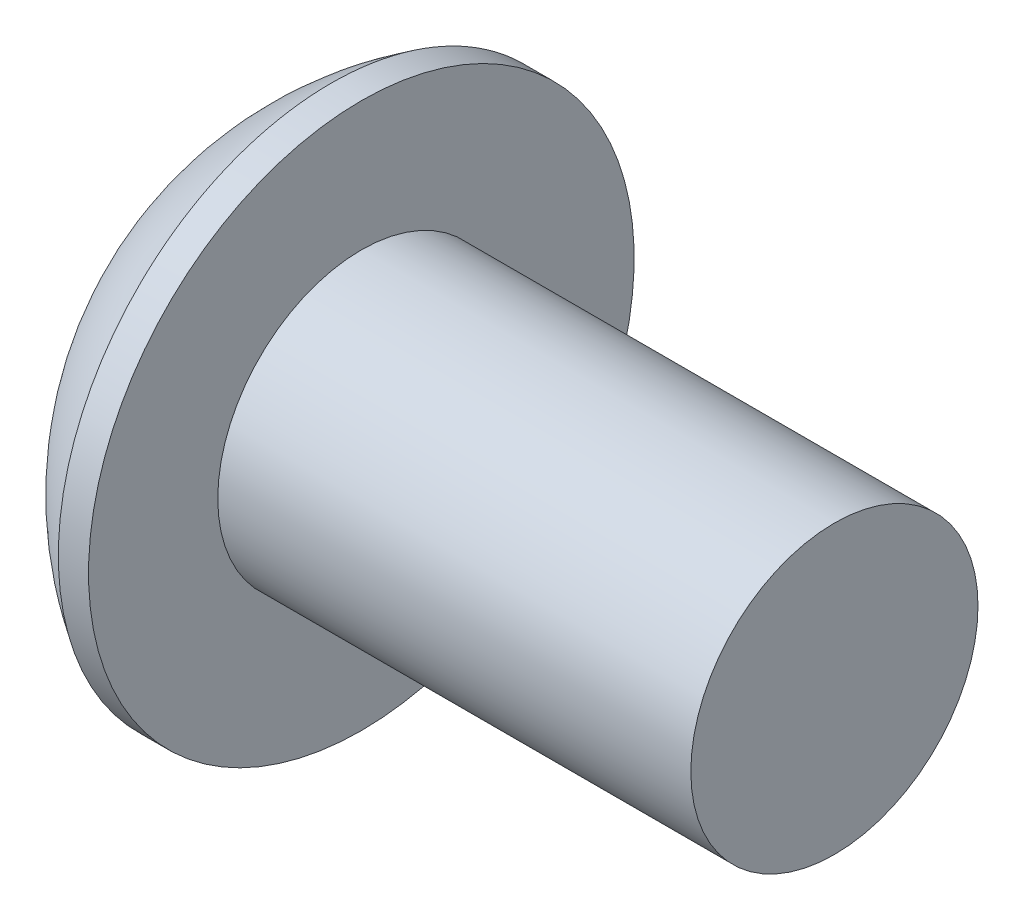
ISO-10303-21;
HEADER;
FILE_DESCRIPTION(('STEP AP214'),'2;1');
FILE_NAME('part.step','',(''),(''),'','','');
FILE_SCHEMA(('AUTOMOTIVE_DESIGN { 1 0 10303 214 1 1 1 1 }'));
ENDSEC;
DATA;
#1=APPLICATION_CONTEXT('core data for automotive mechanical design processes');
#2=APPLICATION_PROTOCOL_DEFINITION('international standard','automotive_design',2000,#1);
#3=PRODUCT_CONTEXT('',#1,'mechanical');
#4=PRODUCT('Part','Part','',(#3));
#5=PRODUCT_RELATED_PRODUCT_CATEGORY('part','',(#4));
#6=PRODUCT_DEFINITION_FORMATION('','',#4);
#7=PRODUCT_DEFINITION_CONTEXT('part definition',#1,'design');
#8=PRODUCT_DEFINITION('design','',#6,#7);
#9=PRODUCT_DEFINITION_SHAPE('','',#8);
#10=(LENGTH_UNIT() NAMED_UNIT(*) SI_UNIT(.MILLI.,.METRE.));
#11=(NAMED_UNIT(*) PLANE_ANGLE_UNIT() SI_UNIT($,.RADIAN.));
#12=(NAMED_UNIT(*) SI_UNIT($,.STERADIAN.) SOLID_ANGLE_UNIT());
#13=UNCERTAINTY_MEASURE_WITH_UNIT(LENGTH_MEASURE(1.E-05),#10,'distance_accuracy_value','');
#14=(GEOMETRIC_REPRESENTATION_CONTEXT(3) GLOBAL_UNCERTAINTY_ASSIGNED_CONTEXT((#13)) GLOBAL_UNIT_ASSIGNED_CONTEXT((#10,
#11,#12)) REPRESENTATION_CONTEXT('',''));
#15=CARTESIAN_POINT('',(0.,0.,0.));
#16=DIRECTION('',(0.,0.,1.));
#17=DIRECTION('',(1.,0.,0.));
#18=AXIS2_PLACEMENT_3D('',#15,#16,#17);
#19=CARTESIAN_POINT('',(-0.533400000000002,0.,0.));
#20=DIRECTION('',(-1.,0.,0.));
#21=DIRECTION('',(0.,0.,1.));
#22=AXIS2_PLACEMENT_3D('',#19,#20,#21);
#23=PLANE('',#22);
#24=DIRECTION('',(0.,0.5,0.866025403784439));
#25=VECTOR('',#24,1.);
#26=CARTESIAN_POINT('',(-0.533400000000002,1.83308710467706,0.));
#27=LINE('',#26,#25);
#28=CARTESIAN_POINT('',(-0.533400000000002,1.83308710467706,0.));
#29=VERTEX_POINT('',#28);
#30=CARTESIAN_POINT('',(-0.533400000000002,0.916543552338531,-1.5875));
#31=VERTEX_POINT('',#30);
#32=EDGE_CURVE('E116',#29,#31,#27,.F.);
#33=ORIENTED_EDGE('',*,*,#32,.T.);
#34=DIRECTION('',(0.,1.,0.));
#35=VECTOR('',#34,1.);
#36=CARTESIAN_POINT('',(-0.533400000000002,0.916543552338531,-1.5875));
#37=LINE('',#36,#35);
#38=CARTESIAN_POINT('',(-0.533400000000002,-0.916543552338531,-1.5875));
#39=VERTEX_POINT('',#38);
#40=EDGE_CURVE('E83',#31,#39,#37,.F.);
#41=ORIENTED_EDGE('',*,*,#40,.T.);
#42=DIRECTION('',(0.,0.5,-0.866025403784439));
#43=VECTOR('',#42,1.);
#44=CARTESIAN_POINT('',(-0.533400000000002,-0.916543552338531,-1.5875));
#45=LINE('',#44,#43);
#46=CARTESIAN_POINT('',(-0.533400000000002,-1.83308710467706,0.));
#47=VERTEX_POINT('',#46);
#48=EDGE_CURVE('E85',#39,#47,#45,.F.);
#49=ORIENTED_EDGE('',*,*,#48,.T.);
#50=DIRECTION('',(0.,-0.5,-0.866025403784439));
#51=VECTOR('',#50,1.);
#52=CARTESIAN_POINT('',(-0.533400000000002,-1.83308710467706,0.));
#53=LINE('',#52,#51);
#54=CARTESIAN_POINT('',(-0.533400000000002,-0.916543552338533,1.5875));
#55=VERTEX_POINT('',#54);
#56=EDGE_CURVE('E86',#47,#55,#53,.F.);
#57=ORIENTED_EDGE('',*,*,#56,.T.);
#58=DIRECTION('',(0.,-1.,0.));
#59=VECTOR('',#58,1.);
#60=CARTESIAN_POINT('',(-0.533400000000002,-0.916543552338532,1.5875));
#61=LINE('',#60,#59);
#62=CARTESIAN_POINT('',(-0.533400000000002,0.916543552338531,1.5875));
#63=VERTEX_POINT('',#62);
#64=EDGE_CURVE('E72',#55,#63,#61,.F.);
#65=ORIENTED_EDGE('',*,*,#64,.T.);
#66=DIRECTION('',(0.,-0.5,0.866025403784439));
#67=VECTOR('',#66,1.);
#68=CARTESIAN_POINT('',(-0.533400000000002,0.916543552338531,1.5875));
#69=LINE('',#68,#67);
#70=EDGE_CURVE('E111',#63,#29,#69,.F.);
#71=ORIENTED_EDGE('',*,*,#70,.T.);
#72=EDGE_LOOP('',(#33,#41,#49,#57,#65,#71));
#73=FACE_BOUND('',#72,.T.);
#74=ADVANCED_FACE('F18',(#73),#23,.T.);
#75=CARTESIAN_POINT('',(-0.533400000000002,-1.83308710467706,0.));
#76=DIRECTION('',(0.,-0.866025403784439,0.5));
#77=DIRECTION('',(0.,-0.5,-0.866025403784439));
#78=AXIS2_PLACEMENT_3D('',#75,#76,#77);
#79=PLANE('',#78);
#80=CARTESIAN_POINT('',(-2.56539999994394,-1.8330871046745,-2.00804498786736E-11));
#81=CARTESIAN_POINT('',(-2.53392818229741,-1.80158505518366,0.0545631502562923));
#82=CARTESIAN_POINT('',(-2.5043050627177,-1.76955629074211,0.110038597579172));
#83=CARTESIAN_POINT('',(-2.45006639539122,-1.70424635317817,0.223158727683824));
#84=CARTESIAN_POINT('',(-2.42548101615987,-1.6709589724711,0.280814162317604));
#85=CARTESIAN_POINT('',(-2.38336609605347,-1.60383660211837,0.397073518091736));
#86=CARTESIAN_POINT('',(-2.36573072948629,-1.57001869730198,0.455647847439699));
#87=CARTESIAN_POINT('',(-2.33856008862263,-1.50163859306838,0.574085662199493));
#88=CARTESIAN_POINT('',(-2.32900454007239,-1.46707848106388,0.633945532106421));
#89=CARTESIAN_POINT('',(-2.32038274183869,-1.40751253669323,0.737116774157155));
#90=CARTESIAN_POINT('',(-2.31910682172836,-1.38258360390154,0.780294952330845));
#91=CARTESIAN_POINT('',(-2.32125913780735,-1.33276652395073,0.866580665890379));
#92=CARTESIAN_POINT('',(-2.32468902284537,-1.30787839414808,0.90968817121394));
#93=CARTESIAN_POINT('',(-2.33605631415915,-1.25834345643267,0.995485200086784));
#94=CARTESIAN_POINT('',(-2.34399762019329,-1.23369687609494,1.03817432946455));
#95=CARTESIAN_POINT('',(-2.36395627681902,-1.18481740842653,1.12283605091316));
#96=CARTESIAN_POINT('',(-2.37597537628367,-1.16058470328902,1.16480832741616));
#97=CARTESIAN_POINT('',(-2.41164383187845,-1.09853862948576,1.27227527965358));
#98=CARTESIAN_POINT('',(-2.43797770752625,-1.06110942924036,1.33710455616529));
#99=CARTESIAN_POINT('',(-2.48243061452926,-1.00607390269188,1.43242888436855));
#100=CARTESIAN_POINT('',(-2.49804835924321,-0.987937988038022,1.46384120999077));
#101=CARTESIAN_POINT('',(-2.53070945051393,-0.951999508520197,1.52608848246242));
#102=CARTESIAN_POINT('',(-2.54775211871235,-0.934196789917587,1.55692369559499));
#103=CARTESIAN_POINT('',(-2.56539999993807,-0.916543552329633,1.58750000001541));
#104=B_SPLINE_CURVE_WITH_KNOTS('',3,(#80,#81,#82,#83,#84,#85,#86,#87,#88,#89,#90,#91,#92,#93,
#94,#95,#96,#97,#98,#99,#100,#101,#102,#103),.UNSPECIFIED.,.F.,.F.,(4,2,2,2,2,2,2,2,2,2,2,4),
(0.,0.211427927732169,0.424087197148228,0.633370156422424,0.842126401515785,0.991537201098734,
1.14100036552056,1.29059292577265,1.44024972414947,1.67781721417335,1.79627069411587,
1.91466809995991),.UNSPECIFIED.);
#105=CARTESIAN_POINT('',(-2.56539999993857,-1.83308710468646,0.));
#106=VERTEX_POINT('',#105);
#107=CARTESIAN_POINT('',(-2.56539999993106,-0.916543552342318,1.5875));
#108=VERTEX_POINT('',#107);
#109=EDGE_CURVE('E21',#106,#108,#104,.T.);
#110=ORIENTED_EDGE('',*,*,#109,.T.);
#111=DIRECTION('',(1.,0.,0.));
#112=VECTOR('',#111,1.);
#113=CARTESIAN_POINT('',(-0.533400000000002,-0.916543552338533,1.5875));
#114=LINE('',#113,#112);
#115=EDGE_CURVE('E91',#108,#55,#114,.T.);
#116=ORIENTED_EDGE('',*,*,#115,.T.);
#117=ORIENTED_EDGE('',*,*,#56,.F.);
#118=DIRECTION('',(1.,0.,0.));
#119=VECTOR('',#118,1.);
#120=CARTESIAN_POINT('',(-0.533400000000002,-1.83308710467706,0.));
#121=LINE('',#120,#119);
#122=EDGE_CURVE('E59',#47,#106,#121,.F.);
#123=ORIENTED_EDGE('',*,*,#122,.T.);
#124=EDGE_LOOP('',(#110,#116,#117,#123));
#125=FACE_BOUND('',#124,.T.);
#126=ADVANCED_FACE('F90',(#125),#79,.F.);
#127=CARTESIAN_POINT('',(-0.533400000000002,-0.916543552338531,-1.5875));
#128=DIRECTION('',(0.,-0.866025403784439,-0.5));
#129=DIRECTION('',(0.,0.5,-0.866025403784439));
#130=AXIS2_PLACEMENT_3D('',#127,#128,#129);
#131=PLANE('',#130);
#132=CARTESIAN_POINT('',(-2.56539999994527,-0.916543552319403,-1.58750000001409));
#133=CARTESIAN_POINT('',(-2.53392818229919,-0.948045601822691,-1.53293684974403));
#134=CARTESIAN_POINT('',(-2.50430506271949,-0.980074366269487,-1.47746140242354));
#135=CARTESIAN_POINT('',(-2.45006639539264,-1.04538430383757,-1.36434127232016));
#136=CARTESIAN_POINT('',(-2.42548101616093,-1.07867168454351,-1.30668583768523));
#137=CARTESIAN_POINT('',(-2.38336609605398,-1.14579405489574,-1.19042648190974));
#138=CARTESIAN_POINT('',(-2.36573072948662,-1.17961195971273,-1.13185215256154));
#139=CARTESIAN_POINT('',(-2.3385600886227,-1.2479920639471,-1.013414337801));
#140=CARTESIAN_POINT('',(-2.32900454007237,-1.28255217595175,-0.953554467893575));
#141=CARTESIAN_POINT('',(-2.32038274183866,-1.34211812032265,-0.850383225842316));
#142=CARTESIAN_POINT('',(-2.31910682172835,-1.36704705311438,-0.807205047668587));
#143=CARTESIAN_POINT('',(-2.32125913780739,-1.41686413306525,-0.720919334108961));
#144=CARTESIAN_POINT('',(-2.32468902284544,-1.44175226286793,-0.67781182878535));
#145=CARTESIAN_POINT('',(-2.33605631415929,-1.49128720058339,-0.592014799912417));
#146=CARTESIAN_POINT('',(-2.34399762019345,-1.51593378092113,-0.54932567053461));
#147=CARTESIAN_POINT('',(-2.36395627681926,-1.56481324858959,-0.464663949085931));
#148=CARTESIAN_POINT('',(-2.37597537628395,-1.58904595372712,-0.422691672582891));
#149=CARTESIAN_POINT('',(-2.41164383187876,-1.65109202753029,-0.315224720345625));
#150=CARTESIAN_POINT('',(-2.43797770752652,-1.6885212277756,-0.250395443834082));
#151=CARTESIAN_POINT('',(-2.48243061452944,-1.74355675432393,-0.15507111563107));
#152=CARTESIAN_POINT('',(-2.49804835924337,-1.76169266897775,-0.123658790008927));
#153=CARTESIAN_POINT('',(-2.53070945051401,-1.79763114849548,-0.0614115175374324));
#154=CARTESIAN_POINT('',(-2.5477521187124,-1.81543386709805,-0.0305763044049344));
#155=CARTESIAN_POINT('',(-2.56539999993807,-1.83308710468596,1.54136844652939E-11));
#156=B_SPLINE_CURVE_WITH_KNOTS('',3,(#132,#133,#134,#135,#136,#137,#138,#139,#140,#141,#142,
#143,#144,#145,#146,#147,#148,#149,#150,#151,#152,#153,#154,#155),.UNSPECIFIED.,.F.,.F.,(4,2,2,
2,2,2,2,2,2,2,2,4),(0.,0.211427927733669,0.424087197151313,0.633370156427101,0.842126401522016,
0.99153720110513,1.14100036552713,1.29059292577937,1.44024972415633,1.67781721417961,
1.79627069412184,1.9146680999656),.UNSPECIFIED.);
#157=CARTESIAN_POINT('',(-2.56539999995198,-0.916543552351339,-1.58750000002218));
#158=VERTEX_POINT('',#157);
#159=EDGE_CURVE('E95',#158,#106,#156,.T.);
#160=ORIENTED_EDGE('',*,*,#159,.T.);
#161=ORIENTED_EDGE('',*,*,#122,.F.);
#162=ORIENTED_EDGE('',*,*,#48,.F.);
#163=DIRECTION('',(-1.,0.,0.));
#164=VECTOR('',#163,1.);
#165=CARTESIAN_POINT('',(-0.533400000000002,-0.916543552338531,-1.5875));
#166=LINE('',#165,#164);
#167=EDGE_CURVE('E97',#39,#158,#166,.T.);
#168=ORIENTED_EDGE('',*,*,#167,.T.);
#169=EDGE_LOOP('',(#160,#161,#162,#168));
#170=FACE_BOUND('',#169,.T.);
#171=ADVANCED_FACE('F93',(#170),#131,.F.);
#172=CARTESIAN_POINT('',(-0.533400000000002,0.916543552338531,-1.5875));
#173=DIRECTION('',(0.,0.,-1.));
#174=DIRECTION('',(-1.,0.,0.));
#175=AXIS2_PLACEMENT_3D('',#172,#173,#174);
#176=PLANE('',#175);
#177=CARTESIAN_POINT('',(-2.56539999994527,0.916543552360294,-1.58749999999048));
#178=CARTESIAN_POINT('',(-2.53392818229821,0.853539453376781,-1.58749999999657));
#179=CARTESIAN_POINT('',(-2.50430506271702,0.789481924500113,-1.58749999999908));
#180=CARTESIAN_POINT('',(-2.45006639538581,0.658862049392287,-1.58750000000093));
#181=CARTESIAN_POINT('',(-2.42548101615122,0.59228728799181,-1.58750000000025));
#182=CARTESIAN_POINT('',(-2.38336609603683,0.458042547310979,-1.58749999999976));
#183=CARTESIAN_POINT('',(-2.36573072946494,0.390406737689213,-1.58749999999994));
#184=CARTESIAN_POINT('',(-2.3385600885904,0.253646529243895,-1.58750000000006));
#185=CARTESIAN_POINT('',(-2.32900454003397,0.184526305245804,-1.58750000000001));
#186=CARTESIAN_POINT('',(-2.32038274178942,0.0653944165301613,-1.58749999999999));
#187=CARTESIAN_POINT('',(-2.31910682167392,0.0155365509618711,-1.5875));
#188=CARTESIAN_POINT('',(-2.3212591377409,-0.0840976089101244,-1.5875));
#189=CARTESIAN_POINT('',(-2.32468902277208,-0.133873868500894,-1.5875));
#190=CARTESIAN_POINT('',(-2.33605631407098,-0.2329437439033,-1.5875));
#191=CARTESIAN_POINT('',(-2.34399762009707,-0.282236904564879,-1.5875));
#192=CARTESIAN_POINT('',(-2.36395627670599,-0.379995839874564,-1.5875));
#193=CARTESIAN_POINT('',(-2.37597537616188,-0.428461250136325,-1.5875));
#194=CARTESIAN_POINT('',(-2.41164383175616,-0.552553397787632,-1.5875));
#195=CARTESIAN_POINT('',(-2.43797770742117,-0.627411798334259,-1.5875));
#196=CARTESIAN_POINT('',(-2.48243061445881,-0.737482851511091,-1.5875));
#197=CARTESIAN_POINT('',(-2.49804835918582,-0.773754680844889,-1.5875));
#198=CARTESIAN_POINT('',(-2.53070945048496,-0.845631639931401,-1.5875));
#199=CARTESIAN_POINT('',(-2.54775211869874,-0.881237077161412,-1.5875));
#200=CARTESIAN_POINT('',(-2.56539999994071,-0.916543552361606,-1.5875));
#201=B_SPLINE_CURVE_WITH_KNOTS('',3,(#177,#178,#179,#180,#181,#182,#183,#184,#185,#186,#187,
#188,#189,#190,#191,#192,#193,#194,#195,#196,#197,#198,#199,#200),.UNSPECIFIED.,.F.,.F.,(4,2,2,
2,2,2,2,2,2,2,2,4),(0.,0.211427927701375,0.424087197086717,0.633370156331471,0.842126401395377,
0.991537200933545,1.14100036531054,1.29059292551773,1.44024972384963,1.677817214047,
1.79627069407681,1.91466810000777),.UNSPECIFIED.);
#202=CARTESIAN_POINT('',(-2.56539999995198,0.916543552337129,-1.58749999999757));
#203=VERTEX_POINT('',#202);
#204=EDGE_CURVE('E199',#203,#158,#201,.T.);
#205=ORIENTED_EDGE('',*,*,#204,.T.);
#206=ORIENTED_EDGE('',*,*,#167,.F.);
#207=ORIENTED_EDGE('',*,*,#40,.F.);
#208=DIRECTION('',(1.,0.,0.));
#209=VECTOR('',#208,1.);
#210=CARTESIAN_POINT('',(-0.533400000000002,0.916543552338531,-1.5875));
#211=LINE('',#210,#209);
#212=EDGE_CURVE('E113',#31,#203,#211,.F.);
#213=ORIENTED_EDGE('',*,*,#212,.T.);
#214=EDGE_LOOP('',(#205,#206,#207,#213));
#215=FACE_BOUND('',#214,.T.);
#216=ADVANCED_FACE('F189',(#215),#176,.F.);
#217=CARTESIAN_POINT('',(-0.533400000000002,1.83308710467706,0.));
#218=DIRECTION('',(0.,0.866025403784439,-0.5));
#219=DIRECTION('',(0.,0.5,0.866025403784439));
#220=AXIS2_PLACEMENT_3D('',#217,#218,#219);
#221=PLANE('',#220);
#222=CARTESIAN_POINT('',(-2.56539999994394,1.8330871046745,2.00800374309997E-11));
#223=CARTESIAN_POINT('',(-2.5339281822974,1.80158505518366,-0.0545631502562965));
#224=CARTESIAN_POINT('',(-2.5043050627177,1.76955629074211,-0.11003859757918));
#225=CARTESIAN_POINT('',(-2.45006639539121,1.70424635317816,-0.22315872768384));
#226=CARTESIAN_POINT('',(-2.42548101615987,1.67095897247109,-0.280814162317626));
#227=CARTESIAN_POINT('',(-2.38336609605347,1.60383660211835,-0.397073518091758));
#228=CARTESIAN_POINT('',(-2.36573072948628,1.57001869730197,-0.455647847439717));
#229=CARTESIAN_POINT('',(-2.33856008862263,1.50163859306837,-0.574085662199503));
#230=CARTESIAN_POINT('',(-2.32900454007239,1.46707848106388,-0.633945532106426));
#231=CARTESIAN_POINT('',(-2.32038274183869,1.40751253669322,-0.737116774157154));
#232=CARTESIAN_POINT('',(-2.31910682172836,1.38258360390154,-0.780294952330843));
#233=CARTESIAN_POINT('',(-2.32125913780735,1.33276652395073,-0.866580665890374));
#234=CARTESIAN_POINT('',(-2.32468902284537,1.30787839414808,-0.909688171213933));
#235=CARTESIAN_POINT('',(-2.33605631415915,1.25834345643267,-0.995485200086777));
#236=CARTESIAN_POINT('',(-2.34399762019328,1.23369687609495,-1.03817432946455));
#237=CARTESIAN_POINT('',(-2.36395627681902,1.18481740842653,-1.12283605091316));
#238=CARTESIAN_POINT('',(-2.37597537628367,1.16058470328902,-1.16480832741616));
#239=CARTESIAN_POINT('',(-2.41164383187872,1.09853862948529,-1.2722752796544));
#240=CARTESIAN_POINT('',(-2.43797770752691,1.06110942923942,-1.33710455616691));
#241=CARTESIAN_POINT('',(-2.48243061453059,1.00607390269029,-1.43242888437131));
#242=CARTESIAN_POINT('',(-2.49804835924479,0.987937988036214,-1.4638412099939));
#243=CARTESIAN_POINT('',(-2.53070945051602,0.951999508517968,-1.52608848246628));
#244=CARTESIAN_POINT('',(-2.54775211871471,0.934196789915152,-1.55692369559921));
#245=CARTESIAN_POINT('',(-2.56539999994071,0.916543552326994,-1.58750000001998));
#246=B_SPLINE_CURVE_WITH_KNOTS('',3,(#222,#223,#224,#225,#226,#227,#228,#229,#230,#231,#232,
#233,#234,#235,#236,#237,#238,#239,#240,#241,#242,#243,#244,#245),.UNSPECIFIED.,.F.,.F.,(4,2,2,
2,2,2,2,2,2,2,2,4),(0.,0.211427927732185,0.424087197148259,0.63337015642244,0.842126401515786,
0.99153720109873,1.14100036552055,1.29059292577265,1.44024972414947,1.67781721417631,
1.7962706941203,1.9146680999658),.UNSPECIFIED.);
#247=CARTESIAN_POINT('',(-2.56539999993857,1.83308710468646,0.));
#248=VERTEX_POINT('',#247);
#249=EDGE_CURVE('E193',#248,#203,#246,.T.);
#250=ORIENTED_EDGE('',*,*,#249,.T.);
#251=ORIENTED_EDGE('',*,*,#212,.F.);
#252=ORIENTED_EDGE('',*,*,#32,.F.);
#253=DIRECTION('',(1.,0.,0.));
#254=VECTOR('',#253,1.);
#255=CARTESIAN_POINT('',(-0.533400000000002,1.83308710467706,0.));
#256=LINE('',#255,#254);
#257=EDGE_CURVE('E108',#29,#248,#256,.F.);
#258=ORIENTED_EDGE('',*,*,#257,.T.);
#259=EDGE_LOOP('',(#250,#251,#252,#258));
#260=FACE_BOUND('',#259,.T.);
#261=ADVANCED_FACE('F185',(#260),#221,.F.);
#262=CARTESIAN_POINT('',(-0.533400000000002,0.916543552338531,1.5875));
#263=DIRECTION('',(0.,0.866025403784439,0.5));
#264=DIRECTION('',(0.,-0.5,0.866025403784439));
#265=AXIS2_PLACEMENT_3D('',#262,#263,#264);
#266=PLANE('',#265);
#267=CARTESIAN_POINT('',(-2.56539999994394,0.91654355231986,1.58750000000782));
#268=CARTESIAN_POINT('',(-2.53392818229741,0.948045601824288,1.5329368497393));
#269=CARTESIAN_POINT('',(-2.5043050627177,0.980074366271431,1.47746140241964));
#270=CARTESIAN_POINT('',(-2.45006639539122,1.04538430383949,1.36434127231737));
#271=CARTESIAN_POINT('',(-2.42548101615987,1.07867168454504,1.30668583768271));
#272=CARTESIAN_POINT('',(-2.38336609605347,1.14579405489669,1.19042648190795));
#273=CARTESIAN_POINT('',(-2.36573072948629,1.17961195971347,1.13185215256022));
#274=CARTESIAN_POINT('',(-2.33856008862263,1.24799206394736,1.01341433780059));
#275=CARTESIAN_POINT('',(-2.32900454007239,1.28255217595174,0.953554467893597));
#276=CARTESIAN_POINT('',(-2.32038274183869,1.34211812032234,0.850383225842832));
#277=CARTESIAN_POINT('',(-2.31910682172836,1.36704705311405,0.807205047669152));
#278=CARTESIAN_POINT('',(-2.32125913780735,1.41686413306487,0.720919334109624));
#279=CARTESIAN_POINT('',(-2.32468902284537,1.44175226286752,0.677811828786061));
#280=CARTESIAN_POINT('',(-2.33605631415915,1.49128720058292,0.592014799913215));
#281=CARTESIAN_POINT('',(-2.34399762019328,1.51593378092065,0.549325670535446));
#282=CARTESIAN_POINT('',(-2.36395627681902,1.56481324858906,0.464663949086841));
#283=CARTESIAN_POINT('',(-2.37597537628367,1.58904595372657,0.422691672583837));
#284=CARTESIAN_POINT('',(-2.41164383187845,1.65109202752983,0.315224720346425));
#285=CARTESIAN_POINT('',(-2.43797770752625,1.68852122777524,0.250395443834706));
#286=CARTESIAN_POINT('',(-2.48243061452926,1.74355675432371,0.155071115631445));
#287=CARTESIAN_POINT('',(-2.49804835924321,1.76169266897757,0.123658790009225));
#288=CARTESIAN_POINT('',(-2.53070945051393,1.7976311484954,0.0614115175375789));
#289=CARTESIAN_POINT('',(-2.54775211871235,1.81543386709801,0.0305763044050067));
#290=CARTESIAN_POINT('',(-2.56539999993807,1.83308710468596,-1.54142580803093E-11));
#291=B_SPLINE_CURVE_WITH_KNOTS('',3,(#267,#268,#269,#270,#271,#272,#273,#274,#275,#276,#277,
#278,#279,#280,#281,#282,#283,#284,#285,#286,#287,#288,#289,#290),.UNSPECIFIED.,.F.,.F.,(4,2,2,
2,2,2,2,2,2,2,2,4),(0.,0.211427927732169,0.424087197148227,0.633370156422423,0.842126401515785,
0.991537201098733,1.14100036552056,1.29059292577265,1.44024972414946,1.67781721417335,
1.79627069411587,1.91466809995991),.UNSPECIFIED.);
#292=CARTESIAN_POINT('',(-2.56539999993857,0.91654355234323,1.58750000000814));
#293=VERTEX_POINT('',#292);
#294=EDGE_CURVE('E167',#293,#248,#291,.T.);
#295=ORIENTED_EDGE('',*,*,#294,.T.);
#296=ORIENTED_EDGE('',*,*,#257,.F.);
#297=ORIENTED_EDGE('',*,*,#70,.F.);
#298=DIRECTION('',(1.,0.,0.));
#299=VECTOR('',#298,1.);
#300=CARTESIAN_POINT('',(-0.533400000000002,0.916543552338531,1.5875));
#301=LINE('',#300,#299);
#302=EDGE_CURVE('E40',#63,#293,#301,.F.);
#303=ORIENTED_EDGE('',*,*,#302,.T.);
#304=EDGE_LOOP('',(#295,#296,#297,#303));
#305=FACE_BOUND('',#304,.T.);
#306=ADVANCED_FACE('F178',(#305),#266,.F.);
#307=CARTESIAN_POINT('',(-0.533400000000002,-0.916543552338532,1.5875));
#308=DIRECTION('',(0.,0.,1.));
#309=DIRECTION('',(0.,-1.,0.));
#310=AXIS2_PLACEMENT_3D('',#307,#308,#309);
#311=PLANE('',#310);
#312=CARTESIAN_POINT('',(-2.56539999994394,-0.916543552354642,1.58749999998774));
#313=CARTESIAN_POINT('',(-2.53392818229741,-0.853539453359365,1.58749999999559));
#314=CARTESIAN_POINT('',(-2.50430506271771,-0.789481924470656,1.58749999999882));
#315=CARTESIAN_POINT('',(-2.45006639539122,-0.658862049338629,1.58750000000119));
#316=CARTESIAN_POINT('',(-2.42548101615988,-0.592287287925995,1.58750000000032));
#317=CARTESIAN_POINT('',(-2.38336609605349,-0.458042547221593,1.58749999999969));
#318=CARTESIAN_POINT('',(-2.36573072948631,-0.390406737588416,1.58749999999992));
#319=CARTESIAN_POINT('',(-2.33856008862266,-0.253646529120892,1.58750000000008));
#320=CARTESIAN_POINT('',(-2.32900454007243,-0.184526305112002,1.58750000000002));
#321=CARTESIAN_POINT('',(-2.32038274183874,-0.065394416370719,1.58749999999999));
#322=CARTESIAN_POINT('',(-2.31910682172841,-0.0155365507873145,1.5875));
#323=CARTESIAN_POINT('',(-2.32125913780742,0.0840976091143436,1.5875));
#324=CARTESIAN_POINT('',(-2.32468902284545,0.133873868719661,1.5875));
#325=CARTESIAN_POINT('',(-2.33605631415924,0.232943744150505,1.5875));
#326=CARTESIAN_POINT('',(-2.34399762019338,0.282236904825971,1.5875));
#327=CARTESIAN_POINT('',(-2.36395627681913,0.379995840162817,1.5875));
#328=CARTESIAN_POINT('',(-2.37597537628379,0.428461250437852,1.5875));
#329=CARTESIAN_POINT('',(-2.41164383187857,0.552553398044325,1.5875));
#330=CARTESIAN_POINT('',(-2.43797770752636,0.627411798535089,1.5875));
#331=CARTESIAN_POINT('',(-2.48243061452933,0.737482851631955,1.5875));
#332=CARTESIAN_POINT('',(-2.49804835924327,0.773754680939651,1.5875));
#333=CARTESIAN_POINT('',(-2.53070945051396,0.84563163997525,1.5875));
#334=CARTESIAN_POINT('',(-2.54775211871237,0.881237077180446,1.5875));
#335=CARTESIAN_POINT('',(-2.56539999993807,0.91654355235633,1.5875));
#336=B_SPLINE_CURVE_WITH_KNOTS('',3,(#312,#313,#314,#315,#316,#317,#318,#319,#320,#321,#322,
#323,#324,#325,#326,#327,#328,#329,#330,#331,#332,#333,#334,#335),.UNSPECIFIED.,.F.,.F.,(4,2,2,
2,2,2,2,2,2,2,2,4),(0.,0.211427927732202,0.424087197148294,0.633370156422521,0.842126401515914,
0.991537201098908,1.14100036552078,1.29059292577292,1.44024972414978,1.67781721417349,
1.79627069411592,1.91466809995988),.UNSPECIFIED.);
#337=EDGE_CURVE('E159',#108,#293,#336,.T.);
#338=ORIENTED_EDGE('',*,*,#337,.T.);
#339=ORIENTED_EDGE('',*,*,#302,.F.);
#340=ORIENTED_EDGE('',*,*,#64,.F.);
#341=ORIENTED_EDGE('',*,*,#115,.F.);
#342=EDGE_LOOP('',(#338,#339,#340,#341));
#343=FACE_BOUND('',#342,.T.);
#344=ADVANCED_FACE('F174',(#343),#311,.F.);
#345=CARTESIAN_POINT('',(-2.56540000003724,0.,0.));
#346=DIRECTION('',(-1.,0.,0.));
#347=DIRECTION('',(0.,-1.,0.));
#348=AXIS2_PLACEMENT_3D('',#345,#346,#347);
#349=CONICAL_SURFACE('',#348,1.83308710478514,0.78539816351237);
#350=ORIENTED_EDGE('',*,*,#109,.F.);
#351=CARTESIAN_POINT('',(-2.56539999992356,0.,0.));
#352=DIRECTION('',(-1.,0.,0.));
#353=DIRECTION('',(0.,-1.,0.));
#354=AXIS2_PLACEMENT_3D('',#351,#352,#353);
#355=CIRCLE('',#354,1.83308710467145);
#356=EDGE_CURVE('E166',#108,#106,#355,.F.);
#357=ORIENTED_EDGE('',*,*,#356,.F.);
#358=EDGE_LOOP('',(#350,#357));
#359=FACE_BOUND('',#358,.T.);
#360=ADVANCED_FACE('F177',(#359),#349,.F.);
#361=CARTESIAN_POINT('',(-2.56540000003724,0.,0.));
#362=DIRECTION('',(-1.,0.,0.));
#363=DIRECTION('',(0.,-1.,0.));
#364=AXIS2_PLACEMENT_3D('',#361,#362,#363);
#365=CONICAL_SURFACE('',#364,1.83308710478514,0.78539816351237);
#366=ORIENTED_EDGE('',*,*,#159,.F.);
#367=CARTESIAN_POINT('',(-2.56539999992356,0.,0.));
#368=DIRECTION('',(-1.,0.,0.));
#369=DIRECTION('',(0.,-1.,0.));
#370=AXIS2_PLACEMENT_3D('',#367,#368,#369);
#371=CIRCLE('',#370,1.83308710467145);
#372=EDGE_CURVE('E273',#106,#158,#371,.F.);
#373=ORIENTED_EDGE('',*,*,#372,.F.);
#374=EDGE_LOOP('',(#366,#373));
#375=FACE_BOUND('',#374,.T.);
#376=ADVANCED_FACE('F211',(#375),#365,.F.);
#377=CARTESIAN_POINT('',(-2.56540000003724,0.,0.));
#378=DIRECTION('',(-1.,0.,0.));
#379=DIRECTION('',(0.,-1.,0.));
#380=AXIS2_PLACEMENT_3D('',#377,#378,#379);
#381=CONICAL_SURFACE('',#380,1.83308710478514,0.785398163397448);
#382=ORIENTED_EDGE('',*,*,#204,.F.);
#383=CARTESIAN_POINT('',(-2.5653999999804,0.,0.));
#384=DIRECTION('',(-1.,0.,0.));
#385=DIRECTION('',(0.,-1.,0.));
#386=AXIS2_PLACEMENT_3D('',#383,#384,#385);
#387=CIRCLE('',#386,1.83308710472829);
#388=EDGE_CURVE('E270',#158,#203,#387,.F.);
#389=ORIENTED_EDGE('',*,*,#388,.F.);
#390=EDGE_LOOP('',(#382,#389));
#391=FACE_BOUND('',#390,.T.);
#392=ADVANCED_FACE('F207',(#391),#381,.F.);
#393=CARTESIAN_POINT('',(-2.56540000003724,0.,0.));
#394=DIRECTION('',(-1.,0.,0.));
#395=DIRECTION('',(0.,-1.,0.));
#396=AXIS2_PLACEMENT_3D('',#393,#394,#395);
#397=CONICAL_SURFACE('',#396,1.83308710478514,0.78539816351237);
#398=ORIENTED_EDGE('',*,*,#249,.F.);
#399=CARTESIAN_POINT('',(-2.56539999992356,0.,0.));
#400=DIRECTION('',(-1.,0.,0.));
#401=DIRECTION('',(0.,-1.,0.));
#402=AXIS2_PLACEMENT_3D('',#399,#400,#401);
#403=CIRCLE('',#402,1.83308710467145);
#404=EDGE_CURVE('E267',#203,#248,#403,.F.);
#405=ORIENTED_EDGE('',*,*,#404,.F.);
#406=EDGE_LOOP('',(#398,#405));
#407=FACE_BOUND('',#406,.T.);
#408=ADVANCED_FACE('F204',(#407),#397,.F.);
#409=CARTESIAN_POINT('',(-2.56540000003724,0.,0.));
#410=DIRECTION('',(-1.,0.,0.));
#411=DIRECTION('',(0.,-1.,0.));
#412=AXIS2_PLACEMENT_3D('',#409,#410,#411);
#413=CONICAL_SURFACE('',#412,1.83308710478514,0.78539816351237);
#414=ORIENTED_EDGE('',*,*,#294,.F.);
#415=CARTESIAN_POINT('',(-2.56539999992356,0.,0.));
#416=DIRECTION('',(-1.,0.,0.));
#417=DIRECTION('',(0.,-1.,0.));
#418=AXIS2_PLACEMENT_3D('',#415,#416,#417);
#419=CIRCLE('',#418,1.83308710467145);
#420=EDGE_CURVE('E262',#248,#293,#419,.F.);
#421=ORIENTED_EDGE('',*,*,#420,.F.);
#422=EDGE_LOOP('',(#414,#421));
#423=FACE_BOUND('',#422,.T.);
#424=ADVANCED_FACE('F154',(#423),#413,.F.);
#425=CARTESIAN_POINT('',(-2.56540000003724,0.,0.));
#426=DIRECTION('',(-1.,0.,0.));
#427=DIRECTION('',(0.,-1.,0.));
#428=AXIS2_PLACEMENT_3D('',#425,#426,#427);
#429=CONICAL_SURFACE('',#428,1.83308710478514,0.785398163512485);
#430=ORIENTED_EDGE('',*,*,#337,.F.);
#431=CARTESIAN_POINT('',(-2.56539999992356,0.,0.));
#432=DIRECTION('',(-1.,0.,0.));
#433=DIRECTION('',(0.,-1.,0.));
#434=AXIS2_PLACEMENT_3D('',#431,#432,#433);
#435=CIRCLE('',#434,1.83308710467145);
#436=EDGE_CURVE('E139',#293,#108,#435,.F.);
#437=ORIENTED_EDGE('',*,*,#436,.F.);
#438=EDGE_LOOP('',(#430,#437));
#439=FACE_BOUND('',#438,.T.);
#440=ADVANCED_FACE('F149',(#439),#429,.F.);
#441=CARTESIAN_POINT('',(-2.5654,0.,0.));
#442=DIRECTION('',(-1.,0.,0.));
#443=DIRECTION('',(0.,-1.,0.));
#444=AXIS2_PLACEMENT_3D('',#441,#442,#443);
#445=PLANE('',#444);
#446=CARTESIAN_POINT('',(-2.5654,-2.29235000000002,0.));
#447=CARTESIAN_POINT('',(-2.56540000000001,-2.29234961429958,-0.0643619991867162));
#448=CARTESIAN_POINT('',(-2.56540000000002,-2.28963695190109,-0.128735826629366));
#449=CARTESIAN_POINT('',(-2.56539999999999,-2.27880393843649,-0.257038618985287));
#450=CARTESIAN_POINT('',(-2.56539999999995,-2.27068199085128,-0.320967446929163));
#451=CARTESIAN_POINT('',(-2.56540000000006,-2.24906694794257,-0.448021254607718));
#452=CARTESIAN_POINT('',(-2.56540000000021,-2.23556532653462,-0.511144793381861));
#453=CARTESIAN_POINT('',(-2.56539999999979,-2.20328400495645,-0.636065176149322));
#454=CARTESIAN_POINT('',(-2.56539999999921,-2.18450002159115,-0.697860899533935));
#455=CARTESIAN_POINT('',(-2.56539999999869,-2.12048422735804,-0.88032980292775));
#456=CARTESIAN_POINT('',(-2.56539999999995,-2.0675359907946,-0.99839179592812));
#457=CARTESIAN_POINT('',(-2.56540000000006,-1.94254204858674,-1.22393765942148));
#458=CARTESIAN_POINT('',(-2.56539999999891,-1.87049561696644,-1.33142112758208));
#459=CARTESIAN_POINT('',(-2.56539999999932,-1.74974254194881,-1.48237719670935));
#460=CARTESIAN_POINT('',(-2.56539999999982,-1.70734573132302,-1.53101280076738));
#461=CARTESIAN_POINT('',(-2.56540000000018,-1.6186391029153,-1.62450601319185));
#462=CARTESIAN_POINT('',(-2.56540000000005,-1.57233309727313,-1.66936721890417));
#463=CARTESIAN_POINT('',(-2.56539999999995,-1.47608431707234,-1.7550488420402));
#464=CARTESIAN_POINT('',(-2.56539999999999,-1.42613990458995,-1.79586741981512));
#465=CARTESIAN_POINT('',(-2.56540000000002,-1.32299452541252,-1.87315615311523));
#466=CARTESIAN_POINT('',(-2.56540000000001,-1.26979280714188,-1.90962529930697));
#467=CARTESIAN_POINT('',(-2.56539999999999,-1.10588180153953,-2.0120772215109));
#468=CARTESIAN_POINT('',(-2.5654,-0.990764947001321,-2.07119486286667));
#469=CARTESIAN_POINT('',(-2.5654,-0.752302198839727,-2.16922858468856));
#470=CARTESIAN_POINT('',(-2.5654,-0.628956393121269,-2.2081448809145));
#471=CARTESIAN_POINT('',(-2.5654,-0.377466101733277,-2.2647275576592));
#472=CARTESIAN_POINT('',(-2.5654,-0.249321590440388,-2.28239382469379));
#473=CARTESIAN_POINT('',(-2.5654,0.0081143537161001,-2.29595665980956));
#474=CARTESIAN_POINT('',(-2.5654,0.137405786579698,-2.29185322789073));
#475=CARTESIAN_POINT('',(-2.5654,0.393449386933719,-2.2620096240906));
#476=CARTESIAN_POINT('',(-2.5654,0.520201567981077,-2.23626956775766));
#477=CARTESIAN_POINT('',(-2.5654,0.767645294384444,-2.16383549332687));
#478=CARTESIAN_POINT('',(-2.5654,0.888336774993549,-2.11714125142686));
#479=CARTESIAN_POINT('',(-2.5654,1.06210572146655,-2.03247976453654));
#480=CARTESIAN_POINT('',(-2.5654,1.11884498714066,-2.00180278323696));
#481=CARTESIAN_POINT('',(-2.5654,1.22954062855572,-1.93578011658036));
#482=CARTESIAN_POINT('',(-2.5654,1.28349764565392,-1.9004355139425));
#483=CARTESIAN_POINT('',(-2.5654,1.38821676641537,-1.82534174602348));
#484=CARTESIAN_POINT('',(-2.5654,1.43898030563028,-1.78559458231503));
#485=CARTESIAN_POINT('',(-2.5654,1.53701984534431,-1.70193996292362));
#486=CARTESIAN_POINT('',(-2.5654,1.5842924328055,-1.65802852924127));
#487=CARTESIAN_POINT('',(-2.5654,1.72023903553758,-1.52059650554139));
#488=CARTESIAN_POINT('',(-2.5654,1.80318066138239,-1.42127847626519));
#489=CARTESIAN_POINT('',(-2.5654,1.95118232345098,-1.21011519784664));
#490=CARTESIAN_POINT('',(-2.5654,2.01624303935584,-1.09827042509272));
#491=CARTESIAN_POINT('',(-2.5654,2.09907772661314,-0.923538238005839));
#492=CARTESIAN_POINT('',(-2.5654,2.12425103063558,-0.864058373981966));
#493=CARTESIAN_POINT('',(-2.5654,2.16947990046565,-0.743221562175601));
#494=CARTESIAN_POINT('',(-2.5654,2.18953960800684,-0.681866178863365));
#495=CARTESIAN_POINT('',(-2.5654,2.22438542051156,-0.557786972400356));
#496=CARTESIAN_POINT('',(-2.5654,2.23917985294818,-0.495065478128172));
#497=CARTESIAN_POINT('',(-2.5654,2.26343456384453,-0.368611258323514));
#498=CARTESIAN_POINT('',(-2.5654,2.27289641559285,-0.304878836759566));
#499=CARTESIAN_POINT('',(-2.5654,2.28388649696736,-0.200873029360621));
#500=CARTESIAN_POINT('',(-2.5654,2.28705930623293,-0.160766164180096));
#501=CARTESIAN_POINT('',(-2.5654,2.29129117827044,-0.0804410725432706));
#502=CARTESIAN_POINT('',(-2.5654,2.29235024104238,-0.0402228460869715));
#503=CARTESIAN_POINT('',(-2.56540000000001,2.29234961429956,0.0643619991867166));
#504=CARTESIAN_POINT('',(-2.56540000000002,2.28963695190107,0.128735826629366));
#505=CARTESIAN_POINT('',(-2.56539999999999,2.27880393843648,0.257038618985288));
#506=CARTESIAN_POINT('',(-2.56539999999995,2.27068199085126,0.320967446929163));
#507=CARTESIAN_POINT('',(-2.56540000000006,2.24906694794255,0.448021254607719));
#508=CARTESIAN_POINT('',(-2.56540000000021,2.2355653265346,0.511144793381862));
#509=CARTESIAN_POINT('',(-2.56539999999979,2.20328400495644,0.636065176149322));
#510=CARTESIAN_POINT('',(-2.56539999999921,2.18450002159113,0.697860899533936));
#511=CARTESIAN_POINT('',(-2.56539999999869,2.12048422735802,0.88032980292775));
#512=CARTESIAN_POINT('',(-2.56539999999995,2.06753599079459,0.998391795928119));
#513=CARTESIAN_POINT('',(-2.56540000000006,1.94254204858672,1.22393765942147));
#514=CARTESIAN_POINT('',(-2.56539999999891,1.87049561696642,1.33142112758208));
#515=CARTESIAN_POINT('',(-2.56539999999933,1.7497425419488,1.48237719670935));
#516=CARTESIAN_POINT('',(-2.56539999999982,1.707345731323,1.53101280076738));
#517=CARTESIAN_POINT('',(-2.56540000000018,1.61863910291529,1.62450601319185));
#518=CARTESIAN_POINT('',(-2.56540000000005,1.57233309727312,1.66936721890418));
#519=CARTESIAN_POINT('',(-2.56539999999995,1.47608431707233,1.75504884204021));
#520=CARTESIAN_POINT('',(-2.56539999999999,1.42613990458993,1.79586741981512));
#521=CARTESIAN_POINT('',(-2.56540000000002,1.3229945254125,1.87315615311523));
#522=CARTESIAN_POINT('',(-2.56540000000001,1.26979280714187,1.90962529930697));
#523=CARTESIAN_POINT('',(-2.56539999999999,1.10588180153952,2.0120772215109));
#524=CARTESIAN_POINT('',(-2.5654,0.990764947001304,2.07119486286667));
#525=CARTESIAN_POINT('',(-2.5654,0.75230219883971,2.16922858468856));
#526=CARTESIAN_POINT('',(-2.5654,0.628956393121252,2.2081448809145));
#527=CARTESIAN_POINT('',(-2.5654,0.377466101733262,2.2647275576592));
#528=CARTESIAN_POINT('',(-2.5654,0.249321590440372,2.28239382469379));
#529=CARTESIAN_POINT('',(-2.5654,-0.00811435371611611,2.29595665980955));
#530=CARTESIAN_POINT('',(-2.5654,-0.137405786579714,2.29185322789072));
#531=CARTESIAN_POINT('',(-2.5654,-0.393449386933735,2.2620096240906));
#532=CARTESIAN_POINT('',(-2.5654,-0.520201567981094,2.23626956775766));
#533=CARTESIAN_POINT('',(-2.5654,-0.767645294384462,2.16383549332688));
#534=CARTESIAN_POINT('',(-2.5654,-0.888336774993567,2.11714125142686));
#535=CARTESIAN_POINT('',(-2.5654,-1.06210572146657,2.03247976453654));
#536=CARTESIAN_POINT('',(-2.5654,-1.11884498714068,2.00180278323695));
#537=CARTESIAN_POINT('',(-2.5654,-1.22954062855574,1.93578011658036));
#538=CARTESIAN_POINT('',(-2.5654,-1.28349764565394,1.9004355139425));
#539=CARTESIAN_POINT('',(-2.5654,-1.38821676641539,1.82534174602348));
#540=CARTESIAN_POINT('',(-2.5654,-1.4389803056303,1.78559458231503));
#541=CARTESIAN_POINT('',(-2.5654,-1.53701984534432,1.70193996292362));
#542=CARTESIAN_POINT('',(-2.5654,-1.58429243280552,1.65802852924127));
#543=CARTESIAN_POINT('',(-2.5654,-1.7202390355376,1.52059650554139));
#544=CARTESIAN_POINT('',(-2.5654,-1.8031806613824,1.42127847626519));
#545=CARTESIAN_POINT('',(-2.5654,-1.951182323451,1.21011519784664));
#546=CARTESIAN_POINT('',(-2.5654,-2.01624303935586,1.09827042509272));
#547=CARTESIAN_POINT('',(-2.5654,-2.09907772661316,0.923538238005837));
#548=CARTESIAN_POINT('',(-2.5654,-2.1242510306356,0.864058373981964));
#549=CARTESIAN_POINT('',(-2.5654,-2.16947990046567,0.743221562175599));
#550=CARTESIAN_POINT('',(-2.5654,-2.18953960800686,0.681866178863365));
#551=CARTESIAN_POINT('',(-2.5654,-2.22438542051158,0.557786972400357));
#552=CARTESIAN_POINT('',(-2.5654,-2.2391798529482,0.495065478128172));
#553=CARTESIAN_POINT('',(-2.5654,-2.26343456384455,0.368611258323514));
#554=CARTESIAN_POINT('',(-2.5654,-2.27289641559287,0.304878836759567));
#555=CARTESIAN_POINT('',(-2.5654,-2.28388649696738,0.200873029360623));
#556=CARTESIAN_POINT('',(-2.5654,-2.28705930623295,0.160766164180096));
#557=CARTESIAN_POINT('',(-2.5654,-2.29129117827046,0.080441072543271));
#558=CARTESIAN_POINT('',(-2.5654,-2.29235024104239,0.0402228460869719));
#559=CARTESIAN_POINT('',(-2.5654,-2.29235000000002,0.));
#560=B_SPLINE_CURVE_WITH_KNOTS('',3,(#446,#447,#448,#449,#450,#451,#452,#453,#454,#455,#456,
#457,#458,#459,#460,#461,#462,#463,#464,#465,#466,#467,#468,#469,#470,#471,#472,#473,#474,#475,
#476,#477,#478,#479,#480,#481,#482,#483,#484,#485,#486,#487,#488,#489,#490,#491,#492,#493,#494,
#495,#496,#497,#498,#499,#500,#501,#502,#503,#504,#505,#506,#507,#508,#509,#510,#511,#512,#513,
#514,#515,#516,#517,#518,#519,#520,#521,#522,#523,#524,#525,#526,#527,#528,#529,#530,#531,#532,
#533,#534,#535,#536,#537,#538,#539,#540,#541,#542,#543,#544,#545,#546,#547,#548,#549,#550,#551,
#552,#553,#554,#555,#556,#557,#558,#559),.UNSPECIFIED.,.T.,.F.,(4,2,2,2,2,2,2,2,2,2,2,2,2,2,2,2,
2,2,2,2,2,2,2,2,2,2,2,2,2,2,2,2,2,2,2,2,2,2,2,2,2,2,2,2,2,2,2,2,2,2,2,2,2,2,2,2,4),(0.,
0.193048968618034,0.386154939782395,0.579568183995959,0.77313871149104,1.15935703864578,
1.54559004914645,1.73895960916369,1.93214273180064,2.12541336477222,2.31872876140889,
2.70495649282619,3.09118009906583,3.47740576789432,3.86363143672286,4.24985504296255,
4.6360827743798,4.82939817101621,5.02266880398749,5.21585192662421,5.40922148664123,
5.79545449714218,6.18167282429725,6.37524335179263,6.56865659600643,6.7617625671709,
6.9548115357891,7.07545693291923,7.19610233004938,7.38915129866742,7.58225726983178,
7.77567051404534,7.96924104154042,8.35545936869516,8.74169237919583,8.93506193921307,
9.12824506185002,9.3215156948216,9.51483109145827,9.90105882287557,10.2872824291152,
10.6735080979437,11.0597337667722,11.4459573730119,11.8321851044292,12.0255005010656,
12.2187711340369,12.4119542566736,12.6053238166906,12.9915568271916,13.3777751543466,
13.571345681842,13.7647589260558,13.9578648972203,14.1509138658385,14.2715592629686,
14.3922046600988),.UNSPECIFIED.);
#561=CARTESIAN_POINT('',(-2.5654,-2.29235000000002,0.));
#562=VERTEX_POINT('',#561);
#563=EDGE_CURVE('E132',#562,#562,#560,.T.);
#564=ORIENTED_EDGE('',*,*,#563,.F.);
#565=EDGE_LOOP('',(#564));
#566=FACE_BOUND('',#565,.T.);
#567=ORIENTED_EDGE('',*,*,#420,.T.);
#568=ORIENTED_EDGE('',*,*,#436,.T.);
#569=ORIENTED_EDGE('',*,*,#356,.T.);
#570=ORIENTED_EDGE('',*,*,#372,.T.);
#571=ORIENTED_EDGE('',*,*,#388,.T.);
#572=ORIENTED_EDGE('',*,*,#404,.T.);
#573=EDGE_LOOP('',(#567,#568,#569,#570,#571,#572));
#574=FACE_BOUND('',#573,.T.);
#575=ADVANCED_FACE('F145',(#566,#574),#445,.T.);
#576=CARTESIAN_POINT('',(2.29449606481481,0.,0.));
#577=DIRECTION('',(0.,1.,0.));
#578=DIRECTION('',(-1.,0.,0.));
#579=AXIS2_PLACEMENT_3D('',#576,#577,#578);
#580=SPHERICAL_SURFACE('',#579,5.37340285883187);
#581=ORIENTED_EDGE('',*,*,#563,.T.);
#582=EDGE_LOOP('',(#581));
#583=FACE_BOUND('',#582,.T.);
#584=CARTESIAN_POINT('',(-0.508,0.,0.));
#585=DIRECTION('',(1.,0.,0.));
#586=DIRECTION('',(0.,1.,0.));
#587=AXIS2_PLACEMENT_3D('',#584,#585,#586);
#588=CIRCLE('',#587,4.5847);
#589=CARTESIAN_POINT('',(-0.508,4.5847,0.));
#590=VERTEX_POINT('',#589);
#591=EDGE_CURVE('E129',#590,#590,#588,.T.);
#592=ORIENTED_EDGE('',*,*,#591,.F.);
#593=EDGE_LOOP('',(#592));
#594=FACE_BOUND('',#593,.T.);
#595=ADVANCED_FACE('F141',(#583,#594),#580,.T.);
#596=CARTESIAN_POINT('',(0.,0.,0.));
#597=DIRECTION('',(1.,0.,0.));
#598=DIRECTION('',(0.,1.,0.));
#599=AXIS2_PLACEMENT_3D('',#596,#597,#598);
#600=CYLINDRICAL_SURFACE('',#599,4.5847);
#601=ORIENTED_EDGE('',*,*,#591,.T.);
#602=EDGE_LOOP('',(#601));
#603=FACE_BOUND('',#602,.T.);
#604=CARTESIAN_POINT('',(0.,0.,0.));
#605=DIRECTION('',(1.,0.,0.));
#606=DIRECTION('',(0.,1.,0.));
#607=AXIS2_PLACEMENT_3D('',#604,#605,#606);
#608=CIRCLE('',#607,4.5847);
#609=CARTESIAN_POINT('',(0.,4.5847,0.));
#610=VERTEX_POINT('',#609);
#611=EDGE_CURVE('E126',#610,#610,#608,.T.);
#612=ORIENTED_EDGE('',*,*,#611,.F.);
#613=EDGE_LOOP('',(#612));
#614=FACE_BOUND('',#613,.T.);
#615=ADVANCED_FACE('F241',(#603,#614),#600,.T.);
#616=CARTESIAN_POINT('',(7.9502,0.,0.));
#617=DIRECTION('',(1.,0.,0.));
#618=DIRECTION('',(0.,1.,0.));
#619=AXIS2_PLACEMENT_3D('',#616,#617,#618);
#620=PLANE('',#619);
#621=CARTESIAN_POINT('',(7.9502,0.,0.));
#622=DIRECTION('',(-1.,0.,0.));
#623=DIRECTION('',(0.,-1.,0.));
#624=AXIS2_PLACEMENT_3D('',#621,#622,#623);
#625=CIRCLE('',#624,2.413);
#626=CARTESIAN_POINT('',(7.9502,-2.413,0.));
#627=VERTEX_POINT('',#626);
#628=EDGE_CURVE('E31',#627,#627,#625,.T.);
#629=ORIENTED_EDGE('',*,*,#628,.F.);
#630=EDGE_LOOP('',(#629));
#631=FACE_BOUND('',#630,.T.);
#632=ADVANCED_FACE('F235',(#631),#620,.T.);
#633=CARTESIAN_POINT('',(0.,4.5847,0.));
#634=DIRECTION('',(1.,0.,0.));
#635=DIRECTION('',(0.,1.,0.));
#636=AXIS2_PLACEMENT_3D('',#633,#634,#635);
#637=PLANE('',#636);
#638=CARTESIAN_POINT('',(0.,0.,0.));
#639=DIRECTION('',(-1.,0.,0.));
#640=DIRECTION('',(0.,-1.,0.));
#641=AXIS2_PLACEMENT_3D('',#638,#639,#640);
#642=CIRCLE('',#641,2.413);
#643=CARTESIAN_POINT('',(0.,-2.413,0.));
#644=VERTEX_POINT('',#643);
#645=EDGE_CURVE('E11',#644,#644,#642,.F.);
#646=ORIENTED_EDGE('',*,*,#645,.F.);
#647=EDGE_LOOP('',(#646));
#648=FACE_BOUND('',#647,.T.);
#649=ORIENTED_EDGE('',*,*,#611,.T.);
#650=EDGE_LOOP('',(#649));
#651=FACE_BOUND('',#650,.T.);
#652=ADVANCED_FACE('F229',(#648,#651),#637,.T.);
#653=CARTESIAN_POINT('',(7.9502,0.,0.));
#654=DIRECTION('',(-1.,0.,0.));
#655=DIRECTION('',(0.,-1.,0.));
#656=AXIS2_PLACEMENT_3D('',#653,#654,#655);
#657=CYLINDRICAL_SURFACE('',#656,2.413);
#658=ORIENTED_EDGE('',*,*,#628,.T.);
#659=EDGE_LOOP('',(#658));
#660=FACE_BOUND('',#659,.T.);
#661=ORIENTED_EDGE('',*,*,#645,.T.);
#662=EDGE_LOOP('',(#661));
#663=FACE_BOUND('',#662,.T.);
#664=ADVANCED_FACE('F227',(#660,#663),#657,.T.);
#665=CLOSED_SHELL('',(#74,#126,#171,#216,#261,#306,#344,#360,#376,#392,#408,#424,#440,#575,#595,
#615,#632,#652,#664));
#666=MANIFOLD_SOLID_BREP('B1',#665);
#667=ADVANCED_BREP_SHAPE_REPRESENTATION('',(#18,#666),#14);
#668=SHAPE_DEFINITION_REPRESENTATION(#9,#667);
ENDSEC;
END-ISO-10303-21;
